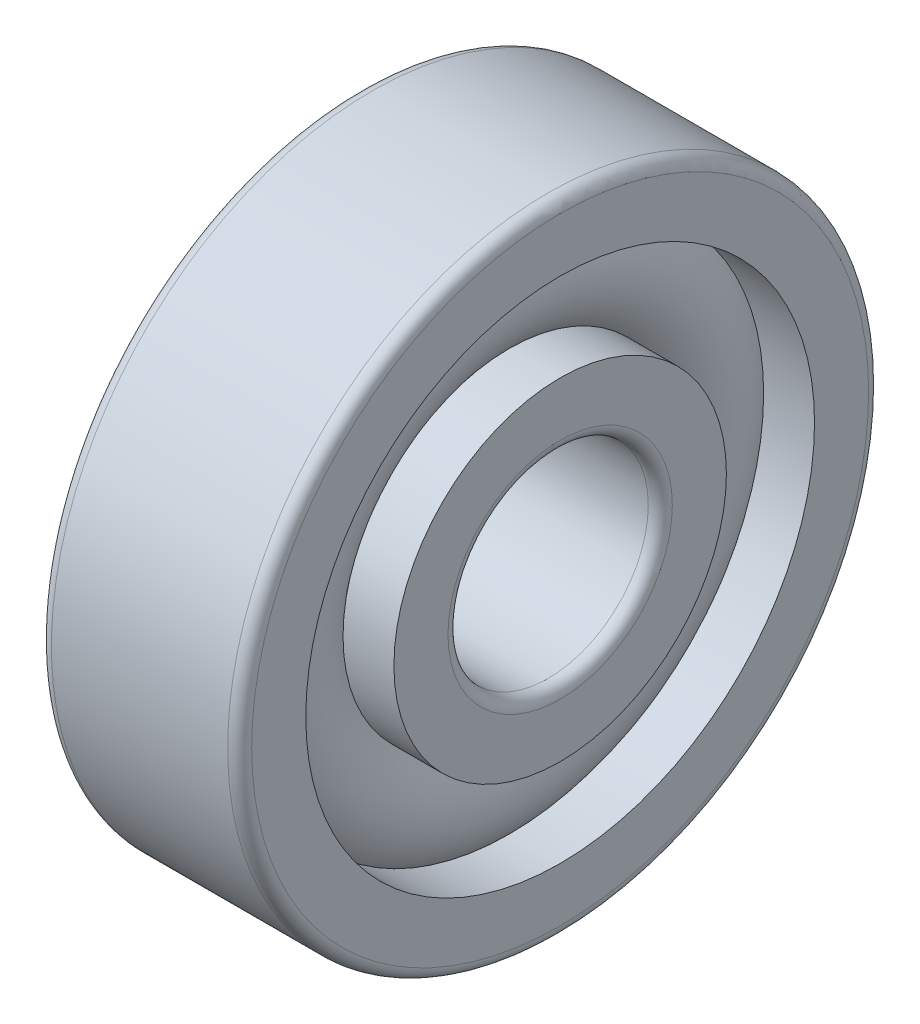
ISO-10303-21;
HEADER;
FILE_DESCRIPTION(('STEP AP214'),'2;1');
FILE_NAME('part.step','',(''),(''),'','','');
FILE_SCHEMA(('AUTOMOTIVE_DESIGN { 1 0 10303 214 1 1 1 1 }'));
ENDSEC;
DATA;
#1=APPLICATION_CONTEXT('core data for automotive mechanical design processes');
#2=APPLICATION_PROTOCOL_DEFINITION('international standard','automotive_design',2000,#1);
#3=PRODUCT_CONTEXT('',#1,'mechanical');
#4=PRODUCT('Part','Part','',(#3));
#5=PRODUCT_RELATED_PRODUCT_CATEGORY('part','',(#4));
#6=PRODUCT_DEFINITION_FORMATION('','',#4);
#7=PRODUCT_DEFINITION_CONTEXT('part definition',#1,'design');
#8=PRODUCT_DEFINITION('design','',#6,#7);
#9=PRODUCT_DEFINITION_SHAPE('','',#8);
#10=(LENGTH_UNIT() NAMED_UNIT(*) SI_UNIT(.MILLI.,.METRE.));
#11=(NAMED_UNIT(*) PLANE_ANGLE_UNIT() SI_UNIT($,.RADIAN.));
#12=(NAMED_UNIT(*) SI_UNIT($,.STERADIAN.) SOLID_ANGLE_UNIT());
#13=UNCERTAINTY_MEASURE_WITH_UNIT(LENGTH_MEASURE(1.E-05),#10,'distance_accuracy_value','');
#14=(GEOMETRIC_REPRESENTATION_CONTEXT(3) GLOBAL_UNCERTAINTY_ASSIGNED_CONTEXT((#13)) GLOBAL_UNIT_ASSIGNED_CONTEXT((#10,
#11,#12)) REPRESENTATION_CONTEXT('',''));
#15=CARTESIAN_POINT('',(0.,0.,0.));
#16=DIRECTION('',(0.,0.,1.));
#17=DIRECTION('',(1.,0.,0.));
#18=AXIS2_PLACEMENT_3D('',#15,#16,#17);
#19=CARTESIAN_POINT('',(-20.6375,0.,0.));
#20=DIRECTION('',(1.,0.,0.));
#21=DIRECTION('',(0.,0.,-1.));
#22=AXIS2_PLACEMENT_3D('',#19,#20,#21);
#23=CYLINDRICAL_SURFACE('',#22,2.5);
#24=CARTESIAN_POINT('',(2.2,0.,0.));
#25=DIRECTION('',(1.,0.,0.));
#26=DIRECTION('',(0.,0.,-1.));
#27=AXIS2_PLACEMENT_3D('',#24,#25,#26);
#28=CIRCLE('',#27,2.5);
#29=CARTESIAN_POINT('',(2.2,0.,-2.5));
#30=VERTEX_POINT('',#29);
#31=EDGE_CURVE('E67',#30,#30,#28,.F.);
#32=ORIENTED_EDGE('',*,*,#31,.F.);
#33=EDGE_LOOP('',(#32));
#34=FACE_BOUND('',#33,.T.);
#35=CARTESIAN_POINT('',(-2.2,0.,0.));
#36=DIRECTION('',(1.,0.,0.));
#37=DIRECTION('',(0.,0.,-1.));
#38=AXIS2_PLACEMENT_3D('',#35,#36,#37);
#39=CIRCLE('',#38,2.5);
#40=CARTESIAN_POINT('',(-2.2,0.,-2.5));
#41=VERTEX_POINT('',#40);
#42=EDGE_CURVE('E130',#41,#41,#39,.T.);
#43=ORIENTED_EDGE('',*,*,#42,.F.);
#44=EDGE_LOOP('',(#43));
#45=FACE_BOUND('',#44,.T.);
#46=ADVANCED_FACE('F16',(#34,#45),#23,.F.);
#47=CARTESIAN_POINT('',(-2.2,0.,0.));
#48=DIRECTION('',(1.,0.,0.));
#49=DIRECTION('',(0.,0.,-1.));
#50=AXIS2_PLACEMENT_3D('',#47,#48,#49);
#51=TOROIDAL_SURFACE('',#50,2.8,0.3);
#52=ORIENTED_EDGE('',*,*,#42,.T.);
#53=EDGE_LOOP('',(#52));
#54=FACE_BOUND('',#53,.T.);
#55=CARTESIAN_POINT('',(-2.5,0.,0.));
#56=DIRECTION('',(-1.,0.,0.));
#57=DIRECTION('',(0.,0.,-1.));
#58=AXIS2_PLACEMENT_3D('',#55,#56,#57);
#59=CIRCLE('',#58,2.8);
#60=CARTESIAN_POINT('',(-2.5,0.,2.8));
#61=VERTEX_POINT('',#60);
#62=CARTESIAN_POINT('',(-2.5,0.,-2.8));
#63=VERTEX_POINT('',#62);
#64=EDGE_CURVE('E57',#61,#63,#59,.F.);
#65=ORIENTED_EDGE('',*,*,#64,.F.);
#66=CARTESIAN_POINT('',(-2.5,0.,0.));
#67=DIRECTION('',(-1.,0.,0.));
#68=DIRECTION('',(0.,0.,1.));
#69=AXIS2_PLACEMENT_3D('',#66,#67,#68);
#70=CIRCLE('',#69,2.8);
#71=EDGE_CURVE('E55',#63,#61,#70,.F.);
#72=ORIENTED_EDGE('',*,*,#71,.F.);
#73=EDGE_LOOP('',(#65,#72));
#74=FACE_BOUND('',#73,.T.);
#75=ADVANCED_FACE('F59',(#54,#74),#51,.T.);
#76=CARTESIAN_POINT('',(2.2,0.,0.));
#77=DIRECTION('',(1.,0.,0.));
#78=DIRECTION('',(0.,0.,-1.));
#79=AXIS2_PLACEMENT_3D('',#76,#77,#78);
#80=TOROIDAL_SURFACE('',#79,2.8,0.3);
#81=CARTESIAN_POINT('',(2.5,0.,0.));
#82=DIRECTION('',(1.,0.,0.));
#83=DIRECTION('',(0.,0.,-1.));
#84=AXIS2_PLACEMENT_3D('',#81,#82,#83);
#85=CIRCLE('',#84,2.8);
#86=CARTESIAN_POINT('',(2.5,0.,2.8));
#87=VERTEX_POINT('',#86);
#88=CARTESIAN_POINT('',(2.5,0.,-2.8));
#89=VERTEX_POINT('',#88);
#90=EDGE_CURVE('E62',#87,#89,#85,.F.);
#91=ORIENTED_EDGE('',*,*,#90,.F.);
#92=CARTESIAN_POINT('',(2.5,0.,0.));
#93=DIRECTION('',(1.,0.,0.));
#94=DIRECTION('',(0.,0.,1.));
#95=AXIS2_PLACEMENT_3D('',#92,#93,#94);
#96=CIRCLE('',#95,2.8);
#97=EDGE_CURVE('E106',#89,#87,#96,.F.);
#98=ORIENTED_EDGE('',*,*,#97,.F.);
#99=EDGE_LOOP('',(#91,#98));
#100=FACE_BOUND('',#99,.T.);
#101=ORIENTED_EDGE('',*,*,#31,.T.);
#102=EDGE_LOOP('',(#101));
#103=FACE_BOUND('',#102,.T.);
#104=ADVANCED_FACE('F87',(#100,#103),#80,.T.);
#105=CARTESIAN_POINT('',(-2.5,4.15,0.));
#106=DIRECTION('',(-1.,0.,0.));
#107=DIRECTION('',(0.,0.,1.));
#108=AXIS2_PLACEMENT_3D('',#105,#106,#107);
#109=PLANE('',#108);
#110=CARTESIAN_POINT('',(-2.5,0.,0.));
#111=DIRECTION('',(1.,0.,0.));
#112=DIRECTION('',(0.,0.,-1.));
#113=AXIS2_PLACEMENT_3D('',#110,#111,#112);
#114=CIRCLE('',#113,4.15);
#115=CARTESIAN_POINT('',(-2.5,0.,-4.15));
#116=VERTEX_POINT('',#115);
#117=EDGE_CURVE('E145',#116,#116,#114,.T.);
#118=ORIENTED_EDGE('',*,*,#117,.F.);
#119=EDGE_LOOP('',(#118));
#120=FACE_BOUND('',#119,.T.);
#121=ORIENTED_EDGE('',*,*,#71,.T.);
#122=ORIENTED_EDGE('',*,*,#64,.T.);
#123=EDGE_LOOP('',(#121,#122));
#124=FACE_BOUND('',#123,.T.);
#125=ADVANCED_FACE('F66',(#120,#124),#109,.T.);
#126=CARTESIAN_POINT('',(2.5,2.8,0.));
#127=DIRECTION('',(1.,0.,0.));
#128=DIRECTION('',(0.,0.,-1.));
#129=AXIS2_PLACEMENT_3D('',#126,#127,#128);
#130=PLANE('',#129);
#131=ORIENTED_EDGE('',*,*,#90,.T.);
#132=ORIENTED_EDGE('',*,*,#97,.T.);
#133=EDGE_LOOP('',(#131,#132));
#134=FACE_BOUND('',#133,.T.);
#135=CARTESIAN_POINT('',(2.5,0.,0.));
#136=DIRECTION('',(1.,0.,0.));
#137=DIRECTION('',(0.,0.,-1.));
#138=AXIS2_PLACEMENT_3D('',#135,#136,#137);
#139=CIRCLE('',#138,4.15);
#140=CARTESIAN_POINT('',(2.5,0.,-4.15));
#141=VERTEX_POINT('',#140);
#142=EDGE_CURVE('E141',#141,#141,#139,.F.);
#143=ORIENTED_EDGE('',*,*,#142,.F.);
#144=EDGE_LOOP('',(#143));
#145=FACE_BOUND('',#144,.T.);
#146=ADVANCED_FACE('F86',(#134,#145),#130,.T.);
#147=CARTESIAN_POINT('',(-20.6375,0.,0.));
#148=DIRECTION('',(1.,0.,0.));
#149=DIRECTION('',(0.,0.,-1.));
#150=AXIS2_PLACEMENT_3D('',#147,#148,#149);
#151=CYLINDRICAL_SURFACE('',#150,4.15);
#152=ORIENTED_EDGE('',*,*,#117,.T.);
#153=EDGE_LOOP('',(#152));
#154=FACE_BOUND('',#153,.T.);
#155=CARTESIAN_POINT('',(-1.22983738762489,0.,0.));
#156=DIRECTION('',(-1.,0.,0.));
#157=DIRECTION('',(0.,0.,1.));
#158=AXIS2_PLACEMENT_3D('',#155,#156,#157);
#159=CIRCLE('',#158,4.15);
#160=CARTESIAN_POINT('',(-1.22983738762489,0.,4.15));
#161=VERTEX_POINT('',#160);
#162=EDGE_CURVE('E144',#161,#161,#159,.F.);
#163=ORIENTED_EDGE('',*,*,#162,.F.);
#164=EDGE_LOOP('',(#163));
#165=FACE_BOUND('',#164,.T.);
#166=ADVANCED_FACE('F279',(#154,#165),#151,.T.);
#167=CARTESIAN_POINT('',(-20.6375,0.,0.));
#168=DIRECTION('',(1.,0.,0.));
#169=DIRECTION('',(0.,0.,-1.));
#170=AXIS2_PLACEMENT_3D('',#167,#168,#169);
#171=CYLINDRICAL_SURFACE('',#170,4.15);
#172=CARTESIAN_POINT('',(1.22983738762488,0.,0.));
#173=DIRECTION('',(-1.,0.,0.));
#174=DIRECTION('',(0.,0.,1.));
#175=AXIS2_PLACEMENT_3D('',#172,#173,#174);
#176=CIRCLE('',#175,4.15);
#177=CARTESIAN_POINT('',(1.22983738762488,0.,4.15));
#178=VERTEX_POINT('',#177);
#179=EDGE_CURVE('E263',#178,#178,#176,.T.);
#180=ORIENTED_EDGE('',*,*,#179,.F.);
#181=EDGE_LOOP('',(#180));
#182=FACE_BOUND('',#181,.T.);
#183=ORIENTED_EDGE('',*,*,#142,.T.);
#184=EDGE_LOOP('',(#183));
#185=FACE_BOUND('',#184,.T.);
#186=ADVANCED_FACE('F258',(#182,#185),#171,.T.);
#187=CARTESIAN_POINT('',(0.,0.,0.));
#188=DIRECTION('',(-1.,0.,0.));
#189=DIRECTION('',(0.,0.,1.));
#190=AXIS2_PLACEMENT_3D('',#187,#188,#189);
#191=TOROIDAL_SURFACE('',#190,5.25,1.65);
#192=CARTESIAN_POINT('',(-1.22983738762488,0.,0.));
#193=DIRECTION('',(1.,0.,0.));
#194=DIRECTION('',(0.,0.,-1.));
#195=AXIS2_PLACEMENT_3D('',#192,#193,#194);
#196=CIRCLE('',#195,6.35);
#197=CARTESIAN_POINT('',(-1.22983738762488,0.,-6.35));
#198=VERTEX_POINT('',#197);
#199=EDGE_CURVE('E262',#198,#198,#196,.F.);
#200=ORIENTED_EDGE('',*,*,#199,.T.);
#201=EDGE_LOOP('',(#200));
#202=FACE_BOUND('',#201,.T.);
#203=ORIENTED_EDGE('',*,*,#162,.T.);
#204=EDGE_LOOP('',(#203));
#205=FACE_BOUND('',#204,.T.);
#206=ADVANCED_FACE('F253',(#202,#205),#191,.T.);
#207=CARTESIAN_POINT('',(0.,0.,0.));
#208=DIRECTION('',(-1.,0.,0.));
#209=DIRECTION('',(0.,0.,1.));
#210=AXIS2_PLACEMENT_3D('',#207,#208,#209);
#211=TOROIDAL_SURFACE('',#210,5.25,1.65);
#212=ORIENTED_EDGE('',*,*,#179,.T.);
#213=EDGE_LOOP('',(#212));
#214=FACE_BOUND('',#213,.T.);
#215=CARTESIAN_POINT('',(1.22983738762488,0.,0.));
#216=DIRECTION('',(1.,0.,0.));
#217=DIRECTION('',(0.,0.,-1.));
#218=AXIS2_PLACEMENT_3D('',#215,#216,#217);
#219=CIRCLE('',#218,6.35);
#220=CARTESIAN_POINT('',(1.22983738762488,0.,-6.35));
#221=VERTEX_POINT('',#220);
#222=EDGE_CURVE('E140',#221,#221,#219,.T.);
#223=ORIENTED_EDGE('',*,*,#222,.T.);
#224=EDGE_LOOP('',(#223));
#225=FACE_BOUND('',#224,.T.);
#226=ADVANCED_FACE('F248',(#214,#225),#211,.T.);
#227=CARTESIAN_POINT('',(-20.6375,0.,0.));
#228=DIRECTION('',(1.,0.,0.));
#229=DIRECTION('',(0.,0.,-1.));
#230=AXIS2_PLACEMENT_3D('',#227,#228,#229);
#231=CYLINDRICAL_SURFACE('',#230,6.35);
#232=ORIENTED_EDGE('',*,*,#199,.F.);
#233=EDGE_LOOP('',(#232));
#234=FACE_BOUND('',#233,.T.);
#235=CARTESIAN_POINT('',(-2.5,0.,0.));
#236=DIRECTION('',(1.,0.,0.));
#237=DIRECTION('',(0.,0.,-1.));
#238=AXIS2_PLACEMENT_3D('',#235,#236,#237);
#239=CIRCLE('',#238,6.35);
#240=CARTESIAN_POINT('',(-2.5,0.,-6.35));
#241=VERTEX_POINT('',#240);
#242=EDGE_CURVE('E137',#241,#241,#239,.T.);
#243=ORIENTED_EDGE('',*,*,#242,.F.);
#244=EDGE_LOOP('',(#243));
#245=FACE_BOUND('',#244,.T.);
#246=ADVANCED_FACE('F252',(#234,#245),#231,.F.);
#247=CARTESIAN_POINT('',(-20.6375,0.,0.));
#248=DIRECTION('',(1.,0.,0.));
#249=DIRECTION('',(0.,0.,-1.));
#250=AXIS2_PLACEMENT_3D('',#247,#248,#249);
#251=CYLINDRICAL_SURFACE('',#250,6.35);
#252=CARTESIAN_POINT('',(2.5,0.,0.));
#253=DIRECTION('',(1.,0.,0.));
#254=DIRECTION('',(0.,0.,-1.));
#255=AXIS2_PLACEMENT_3D('',#252,#253,#254);
#256=CIRCLE('',#255,6.35);
#257=CARTESIAN_POINT('',(2.5,0.,-6.35));
#258=VERTEX_POINT('',#257);
#259=EDGE_CURVE('E133',#258,#258,#256,.F.);
#260=ORIENTED_EDGE('',*,*,#259,.F.);
#261=EDGE_LOOP('',(#260));
#262=FACE_BOUND('',#261,.T.);
#263=ORIENTED_EDGE('',*,*,#222,.F.);
#264=EDGE_LOOP('',(#263));
#265=FACE_BOUND('',#264,.T.);
#266=ADVANCED_FACE('F335',(#262,#265),#251,.F.);
#267=CARTESIAN_POINT('',(-2.5,6.35,0.));
#268=DIRECTION('',(-1.,0.,0.));
#269=DIRECTION('',(0.,0.,1.));
#270=AXIS2_PLACEMENT_3D('',#267,#268,#269);
#271=PLANE('',#270);
#272=CARTESIAN_POINT('',(-2.5,0.,0.));
#273=DIRECTION('',(1.,0.,0.));
#274=DIRECTION('',(0.,0.,-1.));
#275=AXIS2_PLACEMENT_3D('',#272,#273,#274);
#276=CIRCLE('',#275,7.70000000000001);
#277=CARTESIAN_POINT('',(-2.5,0.,-7.70000000000001));
#278=VERTEX_POINT('',#277);
#279=CARTESIAN_POINT('',(-2.5,0.,7.70000000000001));
#280=VERTEX_POINT('',#279);
#281=EDGE_CURVE('E216',#278,#280,#276,.T.);
#282=ORIENTED_EDGE('',*,*,#281,.F.);
#283=CARTESIAN_POINT('',(-2.5,0.,0.));
#284=DIRECTION('',(1.,0.,0.));
#285=DIRECTION('',(0.,0.,1.));
#286=AXIS2_PLACEMENT_3D('',#283,#284,#285);
#287=CIRCLE('',#286,7.70000000000001);
#288=EDGE_CURVE('E136',#280,#278,#287,.T.);
#289=ORIENTED_EDGE('',*,*,#288,.F.);
#290=EDGE_LOOP('',(#282,#289));
#291=FACE_BOUND('',#290,.T.);
#292=ORIENTED_EDGE('',*,*,#242,.T.);
#293=EDGE_LOOP('',(#292));
#294=FACE_BOUND('',#293,.T.);
#295=ADVANCED_FACE('F192',(#291,#294),#271,.T.);
#296=CARTESIAN_POINT('',(2.5,7.70000000000001,0.));
#297=DIRECTION('',(1.,0.,0.));
#298=DIRECTION('',(0.,0.,-1.));
#299=AXIS2_PLACEMENT_3D('',#296,#297,#298);
#300=PLANE('',#299);
#301=ORIENTED_EDGE('',*,*,#259,.T.);
#302=EDGE_LOOP('',(#301));
#303=FACE_BOUND('',#302,.T.);
#304=CARTESIAN_POINT('',(2.5,0.,0.));
#305=DIRECTION('',(-1.,0.,0.));
#306=DIRECTION('',(0.,0.,1.));
#307=AXIS2_PLACEMENT_3D('',#304,#305,#306);
#308=CIRCLE('',#307,7.70000000000001);
#309=CARTESIAN_POINT('',(2.5,0.,7.70000000000001));
#310=VERTEX_POINT('',#309);
#311=CARTESIAN_POINT('',(2.5,0.,-7.70000000000001));
#312=VERTEX_POINT('',#311);
#313=EDGE_CURVE('E179',#310,#312,#308,.T.);
#314=ORIENTED_EDGE('',*,*,#313,.F.);
#315=CARTESIAN_POINT('',(2.5,0.,0.));
#316=DIRECTION('',(-1.,0.,0.));
#317=DIRECTION('',(0.,0.,-1.));
#318=AXIS2_PLACEMENT_3D('',#315,#316,#317);
#319=CIRCLE('',#318,7.70000000000001);
#320=EDGE_CURVE('E34',#312,#310,#319,.T.);
#321=ORIENTED_EDGE('',*,*,#320,.F.);
#322=EDGE_LOOP('',(#314,#321));
#323=FACE_BOUND('',#322,.T.);
#324=ADVANCED_FACE('F183',(#303,#323),#300,.T.);
#325=CARTESIAN_POINT('',(-2.2,0.,0.));
#326=DIRECTION('',(1.,0.,0.));
#327=DIRECTION('',(0.,0.,-1.));
#328=AXIS2_PLACEMENT_3D('',#325,#326,#327);
#329=TOROIDAL_SURFACE('',#328,7.70000000000001,0.299999999999999);
#330=CARTESIAN_POINT('',(-2.2,0.,0.));
#331=DIRECTION('',(1.,0.,0.));
#332=DIRECTION('',(0.,0.,-1.));
#333=AXIS2_PLACEMENT_3D('',#330,#331,#332);
#334=CIRCLE('',#333,8.00000000000001);
#335=CARTESIAN_POINT('',(-2.2,0.,-8.00000000000001));
#336=VERTEX_POINT('',#335);
#337=EDGE_CURVE('E26',#336,#336,#334,.T.);
#338=ORIENTED_EDGE('',*,*,#337,.F.);
#339=EDGE_LOOP('',(#338));
#340=FACE_BOUND('',#339,.T.);
#341=ORIENTED_EDGE('',*,*,#281,.T.);
#342=ORIENTED_EDGE('',*,*,#288,.T.);
#343=EDGE_LOOP('',(#341,#342));
#344=FACE_BOUND('',#343,.T.);
#345=ADVANCED_FACE('F168',(#340,#344),#329,.T.);
#346=CARTESIAN_POINT('',(2.2,0.,0.));
#347=DIRECTION('',(1.,0.,0.));
#348=DIRECTION('',(0.,0.,-1.));
#349=AXIS2_PLACEMENT_3D('',#346,#347,#348);
#350=TOROIDAL_SURFACE('',#349,7.70000000000001,0.299999999999999);
#351=ORIENTED_EDGE('',*,*,#320,.T.);
#352=ORIENTED_EDGE('',*,*,#313,.T.);
#353=EDGE_LOOP('',(#351,#352));
#354=FACE_BOUND('',#353,.T.);
#355=CARTESIAN_POINT('',(2.2,0.,0.));
#356=DIRECTION('',(1.,0.,0.));
#357=DIRECTION('',(0.,0.,-1.));
#358=AXIS2_PLACEMENT_3D('',#355,#356,#357);
#359=CIRCLE('',#358,8.00000000000001);
#360=CARTESIAN_POINT('',(2.2,0.,-8.00000000000001));
#361=VERTEX_POINT('',#360);
#362=EDGE_CURVE('E11',#361,#361,#359,.F.);
#363=ORIENTED_EDGE('',*,*,#362,.F.);
#364=EDGE_LOOP('',(#363));
#365=FACE_BOUND('',#364,.T.);
#366=ADVANCED_FACE('F156',(#354,#365),#350,.T.);
#367=CARTESIAN_POINT('',(-20.6375,0.,0.));
#368=DIRECTION('',(1.,0.,0.));
#369=DIRECTION('',(0.,0.,-1.));
#370=AXIS2_PLACEMENT_3D('',#367,#368,#369);
#371=CYLINDRICAL_SURFACE('',#370,8.00000000000001);
#372=ORIENTED_EDGE('',*,*,#362,.T.);
#373=EDGE_LOOP('',(#372));
#374=FACE_BOUND('',#373,.T.);
#375=ORIENTED_EDGE('',*,*,#337,.T.);
#376=EDGE_LOOP('',(#375));
#377=FACE_BOUND('',#376,.T.);
#378=ADVANCED_FACE('F167',(#374,#377),#371,.T.);
#379=CLOSED_SHELL('',(#46,#75,#104,#125,#146,#166,#186,#206,#226,#246,#266,#295,#324,#345,#366,#378));
#380=MANIFOLD_SOLID_BREP('B1',#379);
#381=ADVANCED_BREP_SHAPE_REPRESENTATION('',(#18,#380),#14);
#382=SHAPE_DEFINITION_REPRESENTATION(#9,#381);
ENDSEC;
END-ISO-10303-21;
